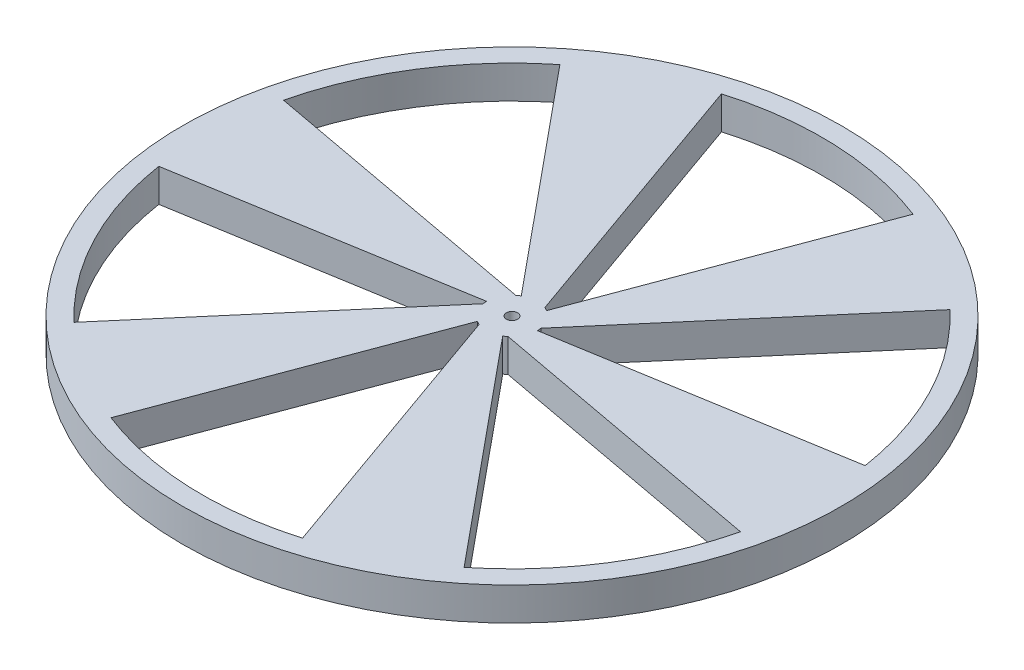
ISO-10303-21;
HEADER;
FILE_DESCRIPTION(('STEP AP214'),'2;1');
FILE_NAME('part.step','',(''),(''),'','','');
FILE_SCHEMA(('AUTOMOTIVE_DESIGN { 1 0 10303 214 1 1 1 1 }'));
ENDSEC;
DATA;
#1=APPLICATION_CONTEXT('core data for automotive mechanical design processes');
#2=APPLICATION_PROTOCOL_DEFINITION('international standard','automotive_design',2000,#1);
#3=PRODUCT_CONTEXT('',#1,'mechanical');
#4=PRODUCT('Part','Part','',(#3));
#5=PRODUCT_RELATED_PRODUCT_CATEGORY('part','',(#4));
#6=PRODUCT_DEFINITION_FORMATION('','',#4);
#7=PRODUCT_DEFINITION_CONTEXT('part definition',#1,'design');
#8=PRODUCT_DEFINITION('design','',#6,#7);
#9=PRODUCT_DEFINITION_SHAPE('','',#8);
#10=(LENGTH_UNIT() NAMED_UNIT(*) SI_UNIT(.MILLI.,.METRE.));
#11=(NAMED_UNIT(*) PLANE_ANGLE_UNIT() SI_UNIT($,.RADIAN.));
#12=(NAMED_UNIT(*) SI_UNIT($,.STERADIAN.) SOLID_ANGLE_UNIT());
#13=UNCERTAINTY_MEASURE_WITH_UNIT(LENGTH_MEASURE(1.E-05),#10,'distance_accuracy_value','');
#14=(GEOMETRIC_REPRESENTATION_CONTEXT(3) GLOBAL_UNCERTAINTY_ASSIGNED_CONTEXT((#13)) GLOBAL_UNIT_ASSIGNED_CONTEXT((#10,
#11,#12)) REPRESENTATION_CONTEXT('',''));
#15=CARTESIAN_POINT('',(0.,0.,0.));
#16=DIRECTION('',(0.,0.,1.));
#17=DIRECTION('',(1.,0.,0.));
#18=AXIS2_PLACEMENT_3D('',#15,#16,#17);
#19=CARTESIAN_POINT('',(0.,5.,0.));
#20=DIRECTION('',(0.,-1.,0.));
#21=DIRECTION('',(0.,0.,-1.));
#22=AXIS2_PLACEMENT_3D('',#19,#20,#21);
#23=CYLINDRICAL_SURFACE('',#22,3.85000000000001);
#24=CARTESIAN_POINT('',(0.,0.,0.));
#25=DIRECTION('',(0.,1.,0.));
#26=DIRECTION('',(0.,0.,1.));
#27=AXIS2_PLACEMENT_3D('',#24,#25,#26);
#28=CIRCLE('',#27,3.85000000000001);
#29=CARTESIAN_POINT('',(1.92499999999997,0.,3.33419780457011));
#30=VERTEX_POINT('',#29);
#31=CARTESIAN_POINT('',(2.41298570240271,0.,3.00000000000002));
#32=VERTEX_POINT('',#31);
#33=EDGE_CURVE('E286',#30,#32,#28,.T.);
#34=ORIENTED_EDGE('',*,*,#33,.T.);
#35=DIRECTION('',(0.,-1.,0.));
#36=VECTOR('',#35,1.);
#37=CARTESIAN_POINT('',(2.41298570240271,5.,3.00000000000002));
#38=LINE('',#37,#36);
#39=CARTESIAN_POINT('',(2.41298570240271,5.,3.00000000000002));
#40=VERTEX_POINT('',#39);
#41=EDGE_CURVE('E11',#40,#32,#38,.T.);
#42=ORIENTED_EDGE('',*,*,#41,.F.);
#43=CARTESIAN_POINT('',(0.,5.,0.));
#44=DIRECTION('',(0.,1.,0.));
#45=DIRECTION('',(0.,0.,1.));
#46=AXIS2_PLACEMENT_3D('',#43,#44,#45);
#47=CIRCLE('',#46,3.85000000000001);
#48=CARTESIAN_POINT('',(1.92499999999997,5.,3.33419780457011));
#49=VERTEX_POINT('',#48);
#50=EDGE_CURVE('E209',#49,#40,#47,.T.);
#51=ORIENTED_EDGE('',*,*,#50,.F.);
#52=DIRECTION('',(0.,-1.,0.));
#53=VECTOR('',#52,1.);
#54=CARTESIAN_POINT('',(1.92499999999997,5.,3.33419780457011));
#55=LINE('',#54,#53);
#56=EDGE_CURVE('E52',#49,#30,#55,.T.);
#57=ORIENTED_EDGE('',*,*,#56,.T.);
#58=EDGE_LOOP('',(#34,#42,#51,#57));
#59=FACE_BOUND('',#58,.T.);
#60=ADVANCED_FACE('F33',(#59),#23,.T.);
#61=CARTESIAN_POINT('',(-0.457445107181056,5.,2.46795427095199));
#62=DIRECTION('',(0.182249707554414,0.,-0.983252278968287));
#63=DIRECTION('',(-0.983252278968287,0.,-0.182249707554414));
#64=AXIS2_PLACEMENT_3D('',#61,#62,#63);
#65=PLANE('',#64);
#66=DIRECTION('',(0.983252278968287,0.,0.182249707554414));
#67=VECTOR('',#66,1.);
#68=CARTESIAN_POINT('',(-0.457445107181056,0.,2.46795427095199));
#69=LINE('',#68,#67);
#70=CARTESIAN_POINT('',(45.6894655600053,0.,11.02146709114));
#71=VERTEX_POINT('',#70);
#72=EDGE_CURVE('E215',#32,#71,#69,.T.);
#73=ORIENTED_EDGE('',*,*,#72,.T.);
#74=DIRECTION('',(0.,-1.,0.));
#75=VECTOR('',#74,1.);
#76=CARTESIAN_POINT('',(45.6894655600053,5.,11.02146709114));
#77=LINE('',#76,#75);
#78=CARTESIAN_POINT('',(45.6894655600053,5.,11.02146709114));
#79=VERTEX_POINT('',#78);
#80=EDGE_CURVE('E43',#79,#71,#77,.T.);
#81=ORIENTED_EDGE('',*,*,#80,.F.);
#82=DIRECTION('',(0.983252278968287,0.,0.182249707554414));
#83=VECTOR('',#82,1.);
#84=CARTESIAN_POINT('',(-0.457445107181056,5.,2.46795427095199));
#85=LINE('',#84,#83);
#86=EDGE_CURVE('E202',#40,#79,#85,.T.);
#87=ORIENTED_EDGE('',*,*,#86,.F.);
#88=ORIENTED_EDGE('',*,*,#41,.T.);
#89=EDGE_LOOP('',(#73,#81,#87,#88));
#90=FACE_BOUND('',#89,.T.);
#91=ADVANCED_FACE('F214',(#90),#65,.F.);
#92=CARTESIAN_POINT('',(0.,5.,0.));
#93=DIRECTION('',(0.,-1.,0.));
#94=DIRECTION('',(0.,0.,-1.));
#95=AXIS2_PLACEMENT_3D('',#92,#93,#94);
#96=CYLINDRICAL_SURFACE('',#95,46.9999999999999);
#97=CARTESIAN_POINT('',(0.,0.,0.));
#98=DIRECTION('',(0.,1.,0.));
#99=DIRECTION('',(0.,0.,1.));
#100=AXIS2_PLACEMENT_3D('',#97,#98,#99);
#101=CIRCLE('',#100,46.9999999999999);
#102=CARTESIAN_POINT('',(29.4021418789474,0.,36.6676158610052));
#103=VERTEX_POINT('',#102);
#104=EDGE_CURVE('E294',#103,#71,#101,.T.);
#105=ORIENTED_EDGE('',*,*,#104,.F.);
#106=DIRECTION('',(0.,-1.,0.));
#107=VECTOR('',#106,1.);
#108=CARTESIAN_POINT('',(29.4021418789474,5.,36.6676158610052));
#109=LINE('',#108,#107);
#110=CARTESIAN_POINT('',(29.4021418789474,5.,36.6676158610052));
#111=VERTEX_POINT('',#110);
#112=EDGE_CURVE('E126',#111,#103,#109,.T.);
#113=ORIENTED_EDGE('',*,*,#112,.F.);
#114=CARTESIAN_POINT('',(0.,5.,0.));
#115=DIRECTION('',(0.,1.,0.));
#116=DIRECTION('',(0.,0.,1.));
#117=AXIS2_PLACEMENT_3D('',#114,#115,#116);
#118=CIRCLE('',#117,46.9999999999999);
#119=EDGE_CURVE('E208',#111,#79,#118,.T.);
#120=ORIENTED_EDGE('',*,*,#119,.T.);
#121=ORIENTED_EDGE('',*,*,#80,.T.);
#122=EDGE_LOOP('',(#105,#113,#120,#121));
#123=FACE_BOUND('',#122,.T.);
#124=ADVANCED_FACE('F219',(#123),#96,.F.);
#125=CARTESIAN_POINT('',(0.104858663641721,5.,0.626666191588406));
#126=DIRECTION('',(-0.165033380048753,0.,-0.986287982016249));
#127=DIRECTION('',(-0.986287982016249,0.,0.165033380048753));
#128=AXIS2_PLACEMENT_3D('',#125,#126,#127);
#129=PLANE('',#128);
#130=DIRECTION('',(0.986287982016249,0.,-0.165033380048753));
#131=VECTOR('',#130,1.);
#132=CARTESIAN_POINT('',(0.104858663641721,0.,0.626666191588406));
#133=LINE('',#132,#131);
#134=CARTESIAN_POINT('',(3.85000000000001,0.,0.));
#135=VERTEX_POINT('',#134);
#136=CARTESIAN_POINT('',(46.4561577713134,0.,-7.12919386234031));
#137=VERTEX_POINT('',#136);
#138=EDGE_CURVE('E317',#135,#137,#133,.T.);
#139=ORIENTED_EDGE('',*,*,#138,.F.);
#140=DIRECTION('',(0.,-1.,0.));
#141=VECTOR('',#140,1.);
#142=CARTESIAN_POINT('',(3.85000000000001,5.,0.));
#143=LINE('',#142,#141);
#144=CARTESIAN_POINT('',(3.85000000000001,5.,0.));
#145=VERTEX_POINT('',#144);
#146=EDGE_CURVE('E337',#145,#135,#143,.T.);
#147=ORIENTED_EDGE('',*,*,#146,.F.);
#148=DIRECTION('',(0.986287982016249,0.,-0.165033380048753));
#149=VECTOR('',#148,1.);
#150=CARTESIAN_POINT('',(0.104858663641721,5.,0.626666191588406));
#151=LINE('',#150,#149);
#152=CARTESIAN_POINT('',(46.4561577713134,5.,-7.12919386234031));
#153=VERTEX_POINT('',#152);
#154=EDGE_CURVE('E260',#145,#153,#151,.T.);
#155=ORIENTED_EDGE('',*,*,#154,.T.);
#156=DIRECTION('',(0.,-1.,0.));
#157=VECTOR('',#156,1.);
#158=CARTESIAN_POINT('',(46.4561577713134,5.,-7.12919386234031));
#159=LINE('',#158,#157);
#160=EDGE_CURVE('E339',#153,#137,#159,.T.);
#161=ORIENTED_EDGE('',*,*,#160,.T.);
#162=EDGE_LOOP('',(#139,#147,#155,#161));
#163=FACE_BOUND('',#162,.T.);
#164=ADVANCED_FACE('F414',(#163),#129,.T.);
#165=CARTESIAN_POINT('',(3.80456906255469,0.,-0.589706917249386));
#166=VERTEX_POINT('',#165);
#167=EDGE_CURVE('E320',#135,#166,#28,.T.);
#168=ORIENTED_EDGE('',*,*,#167,.T.);
#169=DIRECTION('',(0.,-1.,0.));
#170=VECTOR('',#169,1.);
#171=CARTESIAN_POINT('',(3.80456906255469,5.,-0.589706917249386));
#172=LINE('',#171,#170);
#173=CARTESIAN_POINT('',(3.80456906255469,5.,-0.589706917249386));
#174=VERTEX_POINT('',#173);
#175=EDGE_CURVE('E344',#174,#166,#172,.T.);
#176=ORIENTED_EDGE('',*,*,#175,.F.);
#177=EDGE_CURVE('E265',#145,#174,#47,.T.);
#178=ORIENTED_EDGE('',*,*,#177,.F.);
#179=ORIENTED_EDGE('',*,*,#146,.T.);
#180=EDGE_LOOP('',(#168,#176,#178,#179));
#181=FACE_BOUND('',#180,.T.);
#182=ADVANCED_FACE('F406',(#181),#23,.T.);
#183=CARTESIAN_POINT('',(1.9085885404322,5.,1.63013621913168));
#184=DIRECTION('',(-0.760396598138275,0.,-0.649459016058549));
#185=DIRECTION('',(-0.649459016058549,0.,0.760396598138275));
#186=AXIS2_PLACEMENT_3D('',#183,#184,#185);
#187=PLANE('',#186);
#188=DIRECTION('',(0.649459016058549,0.,-0.760396598138275));
#189=VECTOR('',#188,1.);
#190=CARTESIAN_POINT('',(1.9085885404322,0.,1.63013621913168));
#191=LINE('',#190,#189);
#192=CARTESIAN_POINT('',(32.389603267904,0.,-34.0575043147289));
#193=VERTEX_POINT('',#192);
#194=EDGE_CURVE('E321',#166,#193,#191,.T.);
#195=ORIENTED_EDGE('',*,*,#194,.T.);
#196=DIRECTION('',(0.,-1.,0.));
#197=VECTOR('',#196,1.);
#198=CARTESIAN_POINT('',(32.389603267904,5.,-34.0575043147289));
#199=LINE('',#198,#197);
#200=CARTESIAN_POINT('',(32.389603267904,5.,-34.0575043147289));
#201=VERTEX_POINT('',#200);
#202=EDGE_CURVE('E341',#201,#193,#199,.T.);
#203=ORIENTED_EDGE('',*,*,#202,.F.);
#204=DIRECTION('',(0.649459016058549,0.,-0.760396598138275));
#205=VECTOR('',#204,1.);
#206=CARTESIAN_POINT('',(1.9085885404322,5.,1.63013621913168));
#207=LINE('',#206,#205);
#208=EDGE_CURVE('E229',#174,#201,#207,.T.);
#209=ORIENTED_EDGE('',*,*,#208,.F.);
#210=ORIENTED_EDGE('',*,*,#175,.T.);
#211=EDGE_LOOP('',(#195,#203,#209,#210));
#212=FACE_BOUND('',#211,.T.);
#213=ADVANCED_FACE('F413',(#212),#187,.F.);
#214=CARTESIAN_POINT('',(0.595138173429266,5.,0.222522829273583));
#215=DIRECTION('',(-0.936667137897738,0.,-0.35022089141349));
#216=DIRECTION('',(-0.35022089141349,0.,0.936667137897738));
#217=AXIS2_PLACEMENT_3D('',#214,#215,#216);
#218=PLANE('',#217);
#219=DIRECTION('',(0.35022089141349,0.,-0.936667137897738));
#220=VECTOR('',#219,1.);
#221=CARTESIAN_POINT('',(0.595138173429266,0.,0.222522829273583));
#222=LINE('',#221,#220);
#223=CARTESIAN_POINT('',(1.92500000000002,0.,-3.33419780457009));
#224=VERTEX_POINT('',#223);
#225=CARTESIAN_POINT('',(17.0540158923658,0.,-43.7968097233455));
#226=VERTEX_POINT('',#225);
#227=EDGE_CURVE('E309',#224,#226,#222,.T.);
#228=ORIENTED_EDGE('',*,*,#227,.F.);
#229=DIRECTION('',(0.,-1.,0.));
#230=VECTOR('',#229,1.);
#231=CARTESIAN_POINT('',(1.92500000000002,5.,-3.33419780457009));
#232=LINE('',#231,#230);
#233=CARTESIAN_POINT('',(1.92500000000002,5.,-3.33419780457009));
#234=VERTEX_POINT('',#233);
#235=EDGE_CURVE('E342',#234,#224,#232,.T.);
#236=ORIENTED_EDGE('',*,*,#235,.F.);
#237=DIRECTION('',(0.35022089141349,0.,-0.936667137897738));
#238=VECTOR('',#237,1.);
#239=CARTESIAN_POINT('',(0.595138173429266,5.,0.222522829273583));
#240=LINE('',#239,#238);
#241=CARTESIAN_POINT('',(17.0540158923658,5.,-43.7968097233455));
#242=VERTEX_POINT('',#241);
#243=EDGE_CURVE('E251',#234,#242,#240,.T.);
#244=ORIENTED_EDGE('',*,*,#243,.T.);
#245=DIRECTION('',(0.,-1.,0.));
#246=VECTOR('',#245,1.);
#247=CARTESIAN_POINT('',(17.0540158923658,5.,-43.7968097233455));
#248=LINE('',#247,#246);
#249=EDGE_CURVE('E348',#242,#226,#248,.T.);
#250=ORIENTED_EDGE('',*,*,#249,.T.);
#251=EDGE_LOOP('',(#228,#236,#244,#250));
#252=FACE_BOUND('',#251,.T.);
#253=ADVANCED_FACE('F421',(#252),#218,.T.);
#254=CARTESIAN_POINT('',(1.39158336015196,0.,-3.5897069172494));
#255=VERTEX_POINT('',#254);
#256=EDGE_CURVE('E312',#224,#255,#28,.T.);
#257=ORIENTED_EDGE('',*,*,#256,.T.);
#258=DIRECTION('',(0.,-1.,0.));
#259=VECTOR('',#258,1.);
#260=CARTESIAN_POINT('',(1.39158336015196,5.,-3.5897069172494));
#261=LINE('',#260,#259);
#262=CARTESIAN_POINT('',(1.39158336015196,5.,-3.5897069172494));
#263=VERTEX_POINT('',#262);
#264=EDGE_CURVE('E353',#263,#255,#261,.T.);
#265=ORIENTED_EDGE('',*,*,#264,.F.);
#266=EDGE_CURVE('E256',#234,#263,#47,.T.);
#267=ORIENTED_EDGE('',*,*,#266,.F.);
#268=ORIENTED_EDGE('',*,*,#235,.T.);
#269=EDGE_LOOP('',(#257,#265,#267,#268));
#270=FACE_BOUND('',#269,.T.);
#271=ADVANCED_FACE('F416',(#270),#23,.T.);
#272=CARTESIAN_POINT('',(2.36603364761325,5.,-0.837818051820315));
#273=DIRECTION('',(-0.942646305692686,0.,0.333793262909741));
#274=DIRECTION('',(0.333793262909741,0.,0.942646305692686));
#275=AXIS2_PLACEMENT_3D('',#272,#273,#274);
#276=PLANE('',#275);
#277=DIRECTION('',(-0.333793262909741,0.,-0.942646305692686));
#278=VECTOR('',#277,1.);
#279=CARTESIAN_POINT('',(2.36603364761325,0.,-0.837818051820315));
#280=LINE('',#279,#278);
#281=CARTESIAN_POINT('',(-13.2998622921014,0.,-45.0789714058687));
#282=VERTEX_POINT('',#281);
#283=EDGE_CURVE('E313',#255,#282,#280,.T.);
#284=ORIENTED_EDGE('',*,*,#283,.T.);
#285=DIRECTION('',(0.,-1.,0.));
#286=VECTOR('',#285,1.);
#287=CARTESIAN_POINT('',(-13.2998622921014,5.,-45.0789714058687));
#288=LINE('',#287,#286);
#289=CARTESIAN_POINT('',(-13.2998622921014,5.,-45.0789714058687));
#290=VERTEX_POINT('',#289);
#291=EDGE_CURVE('E350',#290,#282,#288,.T.);
#292=ORIENTED_EDGE('',*,*,#291,.F.);
#293=DIRECTION('',(-0.333793262909741,0.,-0.942646305692686));
#294=VECTOR('',#293,1.);
#295=CARTESIAN_POINT('',(2.36603364761325,5.,-0.837818051820315));
#296=LINE('',#295,#294);
#297=EDGE_CURVE('E261',#263,#290,#296,.T.);
#298=ORIENTED_EDGE('',*,*,#297,.F.);
#299=ORIENTED_EDGE('',*,*,#264,.T.);
#300=EDGE_LOOP('',(#284,#292,#298,#299));
#301=FACE_BOUND('',#300,.T.);
#302=ADVANCED_FACE('F427',(#301),#276,.F.);
#303=CARTESIAN_POINT('',(0.490279509787543,5.,-0.404143362314823));
#304=DIRECTION('',(-0.771633757848982,0.,0.63606709060276));
#305=DIRECTION('',(0.63606709060276,0.,0.771633757848982));
#306=AXIS2_PLACEMENT_3D('',#303,#304,#305);
#307=PLANE('',#306);
#308=DIRECTION('',(-0.63606709060276,0.,-0.771633757848982));
#309=VECTOR('',#308,1.);
#310=CARTESIAN_POINT('',(0.490279509787543,0.,-0.404143362314823));
#311=LINE('',#310,#309);
#312=CARTESIAN_POINT('',(-1.925,0.,-3.3341978045701));
#313=VERTEX_POINT('',#312);
#314=CARTESIAN_POINT('',(-29.4021418789477,0.,-36.667615861005));
#315=VERTEX_POINT('',#314);
#316=EDGE_CURVE('E301',#313,#315,#311,.T.);
#317=ORIENTED_EDGE('',*,*,#316,.F.);
#318=DIRECTION('',(0.,-1.,0.));
#319=VECTOR('',#318,1.);
#320=CARTESIAN_POINT('',(-1.925,5.,-3.3341978045701));
#321=LINE('',#320,#319);
#322=CARTESIAN_POINT('',(-1.925,5.,-3.3341978045701));
#323=VERTEX_POINT('',#322);
#324=EDGE_CURVE('E351',#323,#313,#321,.T.);
#325=ORIENTED_EDGE('',*,*,#324,.F.);
#326=DIRECTION('',(-0.63606709060276,0.,-0.771633757848982));
#327=VECTOR('',#326,1.);
#328=CARTESIAN_POINT('',(0.490279509787543,5.,-0.404143362314823));
#329=LINE('',#328,#327);
#330=CARTESIAN_POINT('',(-29.4021418789477,5.,-36.667615861005));
#331=VERTEX_POINT('',#330);
#332=EDGE_CURVE('E241',#323,#331,#329,.T.);
#333=ORIENTED_EDGE('',*,*,#332,.T.);
#334=DIRECTION('',(0.,-1.,0.));
#335=VECTOR('',#334,1.);
#336=CARTESIAN_POINT('',(-29.4021418789477,5.,-36.667615861005));
#337=LINE('',#336,#335);
#338=EDGE_CURVE('E357',#331,#315,#337,.T.);
#339=ORIENTED_EDGE('',*,*,#338,.T.);
#340=EDGE_LOOP('',(#317,#325,#333,#339));
#341=FACE_BOUND('',#340,.T.);
#342=ADVANCED_FACE('F434',(#341),#307,.T.);
#343=CARTESIAN_POINT('',(-2.41298570240273,0.,-3.));
#344=VERTEX_POINT('',#343);
#345=EDGE_CURVE('E304',#313,#344,#28,.T.);
#346=ORIENTED_EDGE('',*,*,#345,.T.);
#347=DIRECTION('',(0.,-1.,0.));
#348=VECTOR('',#347,1.);
#349=CARTESIAN_POINT('',(-2.41298570240273,5.,-3.));
#350=LINE('',#349,#348);
#351=CARTESIAN_POINT('',(-2.41298570240273,5.,-3.));
#352=VERTEX_POINT('',#351);
#353=EDGE_CURVE('E362',#352,#344,#350,.T.);
#354=ORIENTED_EDGE('',*,*,#353,.F.);
#355=EDGE_CURVE('E247',#323,#352,#47,.T.);
#356=ORIENTED_EDGE('',*,*,#355,.F.);
#357=ORIENTED_EDGE('',*,*,#324,.T.);
#358=EDGE_LOOP('',(#346,#354,#356,#357));
#359=FACE_BOUND('',#358,.T.);
#360=ADVANCED_FACE('F429',(#359),#23,.T.);
#361=CARTESIAN_POINT('',(0.457445107181038,5.,-2.46795427095199));
#362=DIRECTION('',(-0.182249707554407,0.,0.983252278968289));
#363=DIRECTION('',(0.983252278968289,0.,0.182249707554407));
#364=AXIS2_PLACEMENT_3D('',#361,#362,#363);
#365=PLANE('',#364);
#366=DIRECTION('',(-0.983252278968289,0.,-0.182249707554407));
#367=VECTOR('',#366,1.);
#368=CARTESIAN_POINT('',(0.457445107181038,0.,-2.46795427095199));
#369=LINE('',#368,#367);
#370=CARTESIAN_POINT('',(-45.6894655600054,0.,-11.0214670911397));
#371=VERTEX_POINT('',#370);
#372=EDGE_CURVE('E305',#344,#371,#369,.T.);
#373=ORIENTED_EDGE('',*,*,#372,.T.);
#374=DIRECTION('',(0.,-1.,0.));
#375=VECTOR('',#374,1.);
#376=CARTESIAN_POINT('',(-45.6894655600054,5.,-11.0214670911397));
#377=LINE('',#376,#375);
#378=CARTESIAN_POINT('',(-45.6894655600054,5.,-11.0214670911397));
#379=VERTEX_POINT('',#378);
#380=EDGE_CURVE('E359',#379,#371,#377,.T.);
#381=ORIENTED_EDGE('',*,*,#380,.F.);
#382=DIRECTION('',(-0.983252278968289,0.,-0.182249707554407));
#383=VECTOR('',#382,1.);
#384=CARTESIAN_POINT('',(0.457445107181038,5.,-2.46795427095199));
#385=LINE('',#384,#383);
#386=EDGE_CURVE('E252',#352,#379,#385,.T.);
#387=ORIENTED_EDGE('',*,*,#386,.F.);
#388=ORIENTED_EDGE('',*,*,#353,.T.);
#389=EDGE_LOOP('',(#373,#381,#387,#388));
#390=FACE_BOUND('',#389,.T.);
#391=ADVANCED_FACE('F441',(#390),#365,.F.);
#392=CARTESIAN_POINT('',(-0.104858663641725,5.,-0.626666191588405));
#393=DIRECTION('',(0.165033380048759,0.,0.986287982016247));
#394=DIRECTION('',(0.986287982016248,0.,-0.165033380048759));
#395=AXIS2_PLACEMENT_3D('',#392,#393,#394);
#396=PLANE('',#395);
#397=DIRECTION('',(-0.986287982016248,0.,0.165033380048759));
#398=VECTOR('',#397,1.);
#399=CARTESIAN_POINT('',(-0.104858663641725,0.,-0.626666191588405));
#400=LINE('',#399,#398);
#401=CARTESIAN_POINT('',(-3.85000000000001,0.,0.));
#402=VERTEX_POINT('',#401);
#403=CARTESIAN_POINT('',(-46.4561577713134,0.,7.12919386234064));
#404=VERTEX_POINT('',#403);
#405=EDGE_CURVE('E293',#402,#404,#400,.T.);
#406=ORIENTED_EDGE('',*,*,#405,.F.);
#407=DIRECTION('',(0.,-1.,0.));
#408=VECTOR('',#407,1.);
#409=CARTESIAN_POINT('',(-3.85000000000001,5.,0.));
#410=LINE('',#409,#408);
#411=CARTESIAN_POINT('',(-3.85000000000001,5.,0.));
#412=VERTEX_POINT('',#411);
#413=EDGE_CURVE('E360',#412,#402,#410,.T.);
#414=ORIENTED_EDGE('',*,*,#413,.F.);
#415=DIRECTION('',(-0.986287982016248,0.,0.165033380048759));
#416=VECTOR('',#415,1.);
#417=CARTESIAN_POINT('',(-0.104858663641725,5.,-0.626666191588405));
#418=LINE('',#417,#416);
#419=CARTESIAN_POINT('',(-46.4561577713134,5.,7.12919386234064));
#420=VERTEX_POINT('',#419);
#421=EDGE_CURVE('E232',#412,#420,#418,.T.);
#422=ORIENTED_EDGE('',*,*,#421,.T.);
#423=DIRECTION('',(0.,-1.,0.));
#424=VECTOR('',#423,1.);
#425=CARTESIAN_POINT('',(-46.4561577713134,5.,7.12919386234064));
#426=LINE('',#425,#424);
#427=EDGE_CURVE('E366',#420,#404,#426,.T.);
#428=ORIENTED_EDGE('',*,*,#427,.T.);
#429=EDGE_LOOP('',(#406,#414,#422,#428));
#430=FACE_BOUND('',#429,.T.);
#431=ADVANCED_FACE('F447',(#430),#396,.T.);
#432=CARTESIAN_POINT('',(-3.80456906255469,0.,0.589706917249358));
#433=VERTEX_POINT('',#432);
#434=EDGE_CURVE('E287',#402,#433,#28,.T.);
#435=ORIENTED_EDGE('',*,*,#434,.T.);
#436=DIRECTION('',(0.,-1.,0.));
#437=VECTOR('',#436,1.);
#438=CARTESIAN_POINT('',(-3.80456906255469,5.,0.589706917249358));
#439=LINE('',#438,#437);
#440=CARTESIAN_POINT('',(-3.80456906255469,5.,0.589706917249358));
#441=VERTEX_POINT('',#440);
#442=EDGE_CURVE('E370',#441,#433,#439,.T.);
#443=ORIENTED_EDGE('',*,*,#442,.F.);
#444=EDGE_CURVE('E238',#412,#441,#47,.T.);
#445=ORIENTED_EDGE('',*,*,#444,.F.);
#446=ORIENTED_EDGE('',*,*,#413,.T.);
#447=EDGE_LOOP('',(#435,#443,#445,#446));
#448=FACE_BOUND('',#447,.T.);
#449=ADVANCED_FACE('F403',(#448),#23,.T.);
#450=CARTESIAN_POINT('',(-1.90858854043219,5.,-1.63013621913169));
#451=DIRECTION('',(0.760396598138271,0.,0.649459016058554));
#452=DIRECTION('',(0.649459016058554,0.,-0.760396598138271));
#453=AXIS2_PLACEMENT_3D('',#450,#451,#452);
#454=PLANE('',#453);
#455=DIRECTION('',(-0.649459016058554,0.,0.760396598138271));
#456=VECTOR('',#455,1.);
#457=CARTESIAN_POINT('',(-1.90858854043219,0.,-1.63013621913169));
#458=LINE('',#457,#456);
#459=CARTESIAN_POINT('',(-32.3896032679043,0.,34.0575043147286));
#460=VERTEX_POINT('',#459);
#461=EDGE_CURVE('E298',#433,#460,#458,.T.);
#462=ORIENTED_EDGE('',*,*,#461,.T.);
#463=DIRECTION('',(0.,-1.,0.));
#464=VECTOR('',#463,1.);
#465=CARTESIAN_POINT('',(-32.3896032679043,5.,34.0575043147286));
#466=LINE('',#465,#464);
#467=CARTESIAN_POINT('',(-32.3896032679043,5.,34.0575043147286));
#468=VERTEX_POINT('',#467);
#469=EDGE_CURVE('E368',#468,#460,#466,.T.);
#470=ORIENTED_EDGE('',*,*,#469,.F.);
#471=DIRECTION('',(-0.649459016058554,0.,0.760396598138271));
#472=VECTOR('',#471,1.);
#473=CARTESIAN_POINT('',(-1.90858854043219,5.,-1.63013621913169));
#474=LINE('',#473,#472);
#475=EDGE_CURVE('E242',#441,#468,#474,.T.);
#476=ORIENTED_EDGE('',*,*,#475,.F.);
#477=ORIENTED_EDGE('',*,*,#442,.T.);
#478=EDGE_LOOP('',(#462,#470,#476,#477));
#479=FACE_BOUND('',#478,.T.);
#480=ADVANCED_FACE('F454',(#479),#454,.F.);
#481=CARTESIAN_POINT('',(-0.595138173429264,5.,-0.222522829273587));
#482=DIRECTION('',(0.936667137897735,0.,0.350220891413497));
#483=DIRECTION('',(0.350220891413497,0.,-0.936667137897735));
#484=AXIS2_PLACEMENT_3D('',#481,#482,#483);
#485=PLANE('',#484);
#486=DIRECTION('',(-0.350220891413497,0.,0.936667137897735));
#487=VECTOR('',#486,1.);
#488=CARTESIAN_POINT('',(-0.595138173429264,0.,-0.222522829273587));
#489=LINE('',#488,#487);
#490=CARTESIAN_POINT('',(-1.92500000000004,0.,3.33419780457007));
#491=VERTEX_POINT('',#490);
#492=CARTESIAN_POINT('',(-17.0540158923661,0.,43.7968097233454));
#493=VERTEX_POINT('',#492);
#494=EDGE_CURVE('E280',#491,#493,#489,.T.);
#495=ORIENTED_EDGE('',*,*,#494,.F.);
#496=DIRECTION('',(0.,-1.,0.));
#497=VECTOR('',#496,1.);
#498=CARTESIAN_POINT('',(-1.92500000000004,5.,3.33419780457007));
#499=LINE('',#498,#497);
#500=CARTESIAN_POINT('',(-1.92500000000004,5.,3.33419780457007));
#501=VERTEX_POINT('',#500);
#502=EDGE_CURVE('E37',#501,#491,#499,.T.);
#503=ORIENTED_EDGE('',*,*,#502,.F.);
#504=DIRECTION('',(-0.350220891413497,0.,0.936667137897735));
#505=VECTOR('',#504,1.);
#506=CARTESIAN_POINT('',(-0.595138173429264,5.,-0.222522829273587));
#507=LINE('',#506,#505);
#508=CARTESIAN_POINT('',(-17.0540158923661,5.,43.7968097233454));
#509=VERTEX_POINT('',#508);
#510=EDGE_CURVE('E335',#501,#509,#507,.T.);
#511=ORIENTED_EDGE('',*,*,#510,.T.);
#512=DIRECTION('',(0.,-1.,0.));
#513=VECTOR('',#512,1.);
#514=CARTESIAN_POINT('',(-17.0540158923661,5.,43.7968097233454));
#515=LINE('',#514,#513);
#516=EDGE_CURVE('E279',#509,#493,#515,.T.);
#517=ORIENTED_EDGE('',*,*,#516,.T.);
#518=EDGE_LOOP('',(#495,#503,#511,#517));
#519=FACE_BOUND('',#518,.T.);
#520=ADVANCED_FACE('F35',(#519),#485,.T.);
#521=CARTESIAN_POINT('',(-1.39158336015199,0.,3.58970691724939));
#522=VERTEX_POINT('',#521);
#523=EDGE_CURVE('E283',#491,#522,#28,.T.);
#524=ORIENTED_EDGE('',*,*,#523,.T.);
#525=DIRECTION('',(0.,-1.,0.));
#526=VECTOR('',#525,1.);
#527=CARTESIAN_POINT('',(-1.39158336015199,5.,3.58970691724939));
#528=LINE('',#527,#526);
#529=CARTESIAN_POINT('',(-1.39158336015199,5.,3.58970691724939));
#530=VERTEX_POINT('',#529);
#531=EDGE_CURVE('E376',#530,#522,#528,.T.);
#532=ORIENTED_EDGE('',*,*,#531,.F.);
#533=EDGE_CURVE('E239',#501,#530,#47,.T.);
#534=ORIENTED_EDGE('',*,*,#533,.F.);
#535=ORIENTED_EDGE('',*,*,#502,.T.);
#536=EDGE_LOOP('',(#524,#532,#534,#535));
#537=FACE_BOUND('',#536,.T.);
#538=ADVANCED_FACE('F384',(#537),#23,.T.);
#539=CARTESIAN_POINT('',(-2.36603364761325,5.,0.837818051820298));
#540=DIRECTION('',(0.942646305692688,0.,-0.333793262909735));
#541=DIRECTION('',(-0.333793262909735,0.,-0.942646305692688));
#542=AXIS2_PLACEMENT_3D('',#539,#540,#541);
#543=PLANE('',#542);
#544=DIRECTION('',(0.333793262909735,0.,0.942646305692688));
#545=VECTOR('',#544,1.);
#546=CARTESIAN_POINT('',(-2.36603364761325,0.,0.837818051820298));
#547=LINE('',#546,#545);
#548=CARTESIAN_POINT('',(13.2998622921011,0.,45.0789714058688));
#549=VERTEX_POINT('',#548);
#550=EDGE_CURVE('E285',#522,#549,#547,.T.);
#551=ORIENTED_EDGE('',*,*,#550,.T.);
#552=DIRECTION('',(0.,-1.,0.));
#553=VECTOR('',#552,1.);
#554=CARTESIAN_POINT('',(13.2998622921011,5.,45.0789714058688));
#555=LINE('',#554,#553);
#556=CARTESIAN_POINT('',(13.2998622921011,5.,45.0789714058688));
#557=VERTEX_POINT('',#556);
#558=EDGE_CURVE('E375',#557,#549,#555,.T.);
#559=ORIENTED_EDGE('',*,*,#558,.F.);
#560=DIRECTION('',(0.333793262909735,0.,0.942646305692688));
#561=VECTOR('',#560,1.);
#562=CARTESIAN_POINT('',(-2.36603364761325,5.,0.837818051820298));
#563=LINE('',#562,#561);
#564=EDGE_CURVE('E233',#530,#557,#563,.T.);
#565=ORIENTED_EDGE('',*,*,#564,.F.);
#566=ORIENTED_EDGE('',*,*,#531,.T.);
#567=EDGE_LOOP('',(#551,#559,#565,#566));
#568=FACE_BOUND('',#567,.T.);
#569=ADVANCED_FACE('F392',(#568),#543,.F.);
#570=CARTESIAN_POINT('',(0.,5.,0.));
#571=DIRECTION('',(0.,-1.,0.));
#572=DIRECTION('',(0.,0.,-1.));
#573=AXIS2_PLACEMENT_3D('',#570,#571,#572);
#574=CYLINDRICAL_SURFACE('',#573,50.);
#575=CARTESIAN_POINT('',(0.,5.,0.));
#576=DIRECTION('',(0.,1.,0.));
#577=DIRECTION('',(0.,0.,1.));
#578=AXIS2_PLACEMENT_3D('',#575,#576,#577);
#579=CIRCLE('',#578,50.);
#580=CARTESIAN_POINT('',(0.,5.,50.));
#581=VERTEX_POINT('',#580);
#582=EDGE_CURVE('E224',#581,#581,#579,.T.);
#583=ORIENTED_EDGE('',*,*,#582,.F.);
#584=EDGE_LOOP('',(#583));
#585=FACE_BOUND('',#584,.T.);
#586=CARTESIAN_POINT('',(0.,0.,0.));
#587=DIRECTION('',(0.,1.,0.));
#588=DIRECTION('',(0.,0.,1.));
#589=AXIS2_PLACEMENT_3D('',#586,#587,#588);
#590=CIRCLE('',#589,50.);
#591=CARTESIAN_POINT('',(0.,0.,50.));
#592=VERTEX_POINT('',#591);
#593=EDGE_CURVE('E329',#592,#592,#590,.T.);
#594=ORIENTED_EDGE('',*,*,#593,.T.);
#595=EDGE_LOOP('',(#594));
#596=FACE_BOUND('',#595,.T.);
#597=ADVANCED_FACE('F394',(#585,#596),#574,.T.);
#598=CARTESIAN_POINT('',(-0.490279509787546,5.,0.40414336231482));
#599=DIRECTION('',(0.771633757848986,0.,-0.636067090602754));
#600=DIRECTION('',(-0.636067090602754,0.,-0.771633757848986));
#601=AXIS2_PLACEMENT_3D('',#598,#599,#600);
#602=PLANE('',#601);
#603=DIRECTION('',(0.636067090602754,0.,0.771633757848986));
#604=VECTOR('',#603,1.);
#605=CARTESIAN_POINT('',(-0.490279509787546,0.,0.40414336231482));
#606=LINE('',#605,#604);
#607=EDGE_CURVE('E326',#30,#103,#606,.T.);
#608=ORIENTED_EDGE('',*,*,#607,.F.);
#609=ORIENTED_EDGE('',*,*,#56,.F.);
#610=DIRECTION('',(0.636067090602754,0.,0.771633757848986));
#611=VECTOR('',#610,1.);
#612=CARTESIAN_POINT('',(-0.490279509787546,5.,0.40414336231482));
#613=LINE('',#612,#611);
#614=EDGE_CURVE('E220',#49,#111,#613,.T.);
#615=ORIENTED_EDGE('',*,*,#614,.T.);
#616=ORIENTED_EDGE('',*,*,#112,.T.);
#617=EDGE_LOOP('',(#608,#609,#615,#616));
#618=FACE_BOUND('',#617,.T.);
#619=ADVANCED_FACE('F399',(#618),#602,.T.);
#620=EDGE_CURVE('E324',#137,#193,#101,.T.);
#621=ORIENTED_EDGE('',*,*,#620,.F.);
#622=ORIENTED_EDGE('',*,*,#160,.F.);
#623=EDGE_CURVE('E222',#153,#201,#118,.T.);
#624=ORIENTED_EDGE('',*,*,#623,.T.);
#625=ORIENTED_EDGE('',*,*,#202,.T.);
#626=EDGE_LOOP('',(#621,#622,#624,#625));
#627=FACE_BOUND('',#626,.T.);
#628=ADVANCED_FACE('F481',(#627),#96,.F.);
#629=EDGE_CURVE('E316',#226,#282,#101,.T.);
#630=ORIENTED_EDGE('',*,*,#629,.F.);
#631=ORIENTED_EDGE('',*,*,#249,.F.);
#632=EDGE_CURVE('E230',#242,#290,#118,.T.);
#633=ORIENTED_EDGE('',*,*,#632,.T.);
#634=ORIENTED_EDGE('',*,*,#291,.T.);
#635=EDGE_LOOP('',(#630,#631,#633,#634));
#636=FACE_BOUND('',#635,.T.);
#637=ADVANCED_FACE('F486',(#636),#96,.F.);
#638=EDGE_CURVE('E308',#315,#371,#101,.T.);
#639=ORIENTED_EDGE('',*,*,#638,.F.);
#640=ORIENTED_EDGE('',*,*,#338,.F.);
#641=EDGE_CURVE('E243',#331,#379,#118,.T.);
#642=ORIENTED_EDGE('',*,*,#641,.T.);
#643=ORIENTED_EDGE('',*,*,#380,.T.);
#644=EDGE_LOOP('',(#639,#640,#642,#643));
#645=FACE_BOUND('',#644,.T.);
#646=ADVANCED_FACE('F501',(#645),#96,.F.);
#647=EDGE_CURVE('E295',#404,#460,#101,.T.);
#648=ORIENTED_EDGE('',*,*,#647,.F.);
#649=ORIENTED_EDGE('',*,*,#427,.F.);
#650=EDGE_CURVE('E234',#420,#468,#118,.T.);
#651=ORIENTED_EDGE('',*,*,#650,.T.);
#652=ORIENTED_EDGE('',*,*,#469,.T.);
#653=EDGE_LOOP('',(#648,#649,#651,#652));
#654=FACE_BOUND('',#653,.T.);
#655=ADVANCED_FACE('F495',(#654),#96,.F.);
#656=EDGE_CURVE('E290',#493,#549,#101,.T.);
#657=ORIENTED_EDGE('',*,*,#656,.F.);
#658=ORIENTED_EDGE('',*,*,#516,.F.);
#659=EDGE_CURVE('E223',#509,#557,#118,.T.);
#660=ORIENTED_EDGE('',*,*,#659,.T.);
#661=ORIENTED_EDGE('',*,*,#558,.T.);
#662=EDGE_LOOP('',(#657,#658,#660,#661));
#663=FACE_BOUND('',#662,.T.);
#664=ADVANCED_FACE('F390',(#663),#96,.F.);
#665=CARTESIAN_POINT('',(0.,5.,0.));
#666=DIRECTION('',(0.,-1.,0.));
#667=DIRECTION('',(0.,0.,-1.));
#668=AXIS2_PLACEMENT_3D('',#665,#666,#667);
#669=CYLINDRICAL_SURFACE('',#668,0.85);
#670=CARTESIAN_POINT('',(0.,5.,0.));
#671=DIRECTION('',(0.,1.,0.));
#672=DIRECTION('',(0.,0.,1.));
#673=AXIS2_PLACEMENT_3D('',#670,#671,#672);
#674=CIRCLE('',#673,0.85);
#675=CARTESIAN_POINT('',(0.,5.,0.85));
#676=VERTEX_POINT('',#675);
#677=EDGE_CURVE('E276',#676,#676,#674,.T.);
#678=ORIENTED_EDGE('',*,*,#677,.T.);
#679=EDGE_LOOP('',(#678));
#680=FACE_BOUND('',#679,.T.);
#681=CARTESIAN_POINT('',(0.,0.,0.));
#682=DIRECTION('',(0.,1.,0.));
#683=DIRECTION('',(0.,0.,1.));
#684=AXIS2_PLACEMENT_3D('',#681,#682,#683);
#685=CIRCLE('',#684,0.85);
#686=CARTESIAN_POINT('',(0.,0.,0.85));
#687=VERTEX_POINT('',#686);
#688=EDGE_CURVE('E332',#687,#687,#685,.T.);
#689=ORIENTED_EDGE('',*,*,#688,.F.);
#690=EDGE_LOOP('',(#689));
#691=FACE_BOUND('',#690,.T.);
#692=ADVANCED_FACE('F494',(#680,#691),#669,.F.);
#693=CARTESIAN_POINT('',(0.,5.,0.));
#694=DIRECTION('',(0.,1.,0.));
#695=DIRECTION('',(0.,0.,1.));
#696=AXIS2_PLACEMENT_3D('',#693,#694,#695);
#697=PLANE('',#696);
#698=ORIENTED_EDGE('',*,*,#510,.F.);
#699=ORIENTED_EDGE('',*,*,#533,.T.);
#700=ORIENTED_EDGE('',*,*,#564,.T.);
#701=ORIENTED_EDGE('',*,*,#659,.F.);
#702=EDGE_LOOP('',(#698,#699,#700,#701));
#703=FACE_BOUND('',#702,.T.);
#704=ORIENTED_EDGE('',*,*,#421,.F.);
#705=ORIENTED_EDGE('',*,*,#444,.T.);
#706=ORIENTED_EDGE('',*,*,#475,.T.);
#707=ORIENTED_EDGE('',*,*,#650,.F.);
#708=EDGE_LOOP('',(#704,#705,#706,#707));
#709=FACE_BOUND('',#708,.T.);
#710=ORIENTED_EDGE('',*,*,#332,.F.);
#711=ORIENTED_EDGE('',*,*,#355,.T.);
#712=ORIENTED_EDGE('',*,*,#386,.T.);
#713=ORIENTED_EDGE('',*,*,#641,.F.);
#714=EDGE_LOOP('',(#710,#711,#712,#713));
#715=FACE_BOUND('',#714,.T.);
#716=ORIENTED_EDGE('',*,*,#243,.F.);
#717=ORIENTED_EDGE('',*,*,#266,.T.);
#718=ORIENTED_EDGE('',*,*,#297,.T.);
#719=ORIENTED_EDGE('',*,*,#632,.F.);
#720=EDGE_LOOP('',(#716,#717,#718,#719));
#721=FACE_BOUND('',#720,.T.);
#722=ORIENTED_EDGE('',*,*,#154,.F.);
#723=ORIENTED_EDGE('',*,*,#177,.T.);
#724=ORIENTED_EDGE('',*,*,#208,.T.);
#725=ORIENTED_EDGE('',*,*,#623,.F.);
#726=EDGE_LOOP('',(#722,#723,#724,#725));
#727=FACE_BOUND('',#726,.T.);
#728=ORIENTED_EDGE('',*,*,#50,.T.);
#729=ORIENTED_EDGE('',*,*,#86,.T.);
#730=ORIENTED_EDGE('',*,*,#119,.F.);
#731=ORIENTED_EDGE('',*,*,#614,.F.);
#732=EDGE_LOOP('',(#728,#729,#730,#731));
#733=FACE_BOUND('',#732,.T.);
#734=ORIENTED_EDGE('',*,*,#582,.T.);
#735=EDGE_LOOP('',(#734));
#736=FACE_BOUND('',#735,.T.);
#737=ORIENTED_EDGE('',*,*,#677,.F.);
#738=EDGE_LOOP('',(#737));
#739=FACE_BOUND('',#738,.T.);
#740=ADVANCED_FACE('F204',(#703,#709,#715,#721,#727,#733,#736,#739),#697,.T.);
#741=CARTESIAN_POINT('',(0.,0.,0.));
#742=DIRECTION('',(0.,1.,0.));
#743=DIRECTION('',(0.,0.,1.));
#744=AXIS2_PLACEMENT_3D('',#741,#742,#743);
#745=PLANE('',#744);
#746=ORIENTED_EDGE('',*,*,#494,.T.);
#747=ORIENTED_EDGE('',*,*,#656,.T.);
#748=ORIENTED_EDGE('',*,*,#550,.F.);
#749=ORIENTED_EDGE('',*,*,#523,.F.);
#750=EDGE_LOOP('',(#746,#747,#748,#749));
#751=FACE_BOUND('',#750,.T.);
#752=ORIENTED_EDGE('',*,*,#405,.T.);
#753=ORIENTED_EDGE('',*,*,#647,.T.);
#754=ORIENTED_EDGE('',*,*,#461,.F.);
#755=ORIENTED_EDGE('',*,*,#434,.F.);
#756=EDGE_LOOP('',(#752,#753,#754,#755));
#757=FACE_BOUND('',#756,.T.);
#758=ORIENTED_EDGE('',*,*,#316,.T.);
#759=ORIENTED_EDGE('',*,*,#638,.T.);
#760=ORIENTED_EDGE('',*,*,#372,.F.);
#761=ORIENTED_EDGE('',*,*,#345,.F.);
#762=EDGE_LOOP('',(#758,#759,#760,#761));
#763=FACE_BOUND('',#762,.T.);
#764=ORIENTED_EDGE('',*,*,#227,.T.);
#765=ORIENTED_EDGE('',*,*,#629,.T.);
#766=ORIENTED_EDGE('',*,*,#283,.F.);
#767=ORIENTED_EDGE('',*,*,#256,.F.);
#768=EDGE_LOOP('',(#764,#765,#766,#767));
#769=FACE_BOUND('',#768,.T.);
#770=ORIENTED_EDGE('',*,*,#138,.T.);
#771=ORIENTED_EDGE('',*,*,#620,.T.);
#772=ORIENTED_EDGE('',*,*,#194,.F.);
#773=ORIENTED_EDGE('',*,*,#167,.F.);
#774=EDGE_LOOP('',(#770,#771,#772,#773));
#775=FACE_BOUND('',#774,.T.);
#776=ORIENTED_EDGE('',*,*,#33,.F.);
#777=ORIENTED_EDGE('',*,*,#607,.T.);
#778=ORIENTED_EDGE('',*,*,#104,.T.);
#779=ORIENTED_EDGE('',*,*,#72,.F.);
#780=EDGE_LOOP('',(#776,#777,#778,#779));
#781=FACE_BOUND('',#780,.T.);
#782=ORIENTED_EDGE('',*,*,#593,.F.);
#783=EDGE_LOOP('',(#782));
#784=FACE_BOUND('',#783,.T.);
#785=ORIENTED_EDGE('',*,*,#688,.T.);
#786=EDGE_LOOP('',(#785));
#787=FACE_BOUND('',#786,.T.);
#788=ADVANCED_FACE('F387',(#751,#757,#763,#769,#775,#781,#784,#787),#745,.F.);
#789=CLOSED_SHELL('',(#60,#91,#124,#164,#182,#213,#253,#271,#302,#342,#360,#391,#431,#449,#480,
#520,#538,#569,#597,#619,#628,#637,#646,#655,#664,#692,#740,#788));
#790=MANIFOLD_SOLID_BREP('B2',#789);
#791=ADVANCED_BREP_SHAPE_REPRESENTATION('',(#18,#790),#14);
#792=SHAPE_DEFINITION_REPRESENTATION(#9,#791);
ENDSEC;
END-ISO-10303-21;
